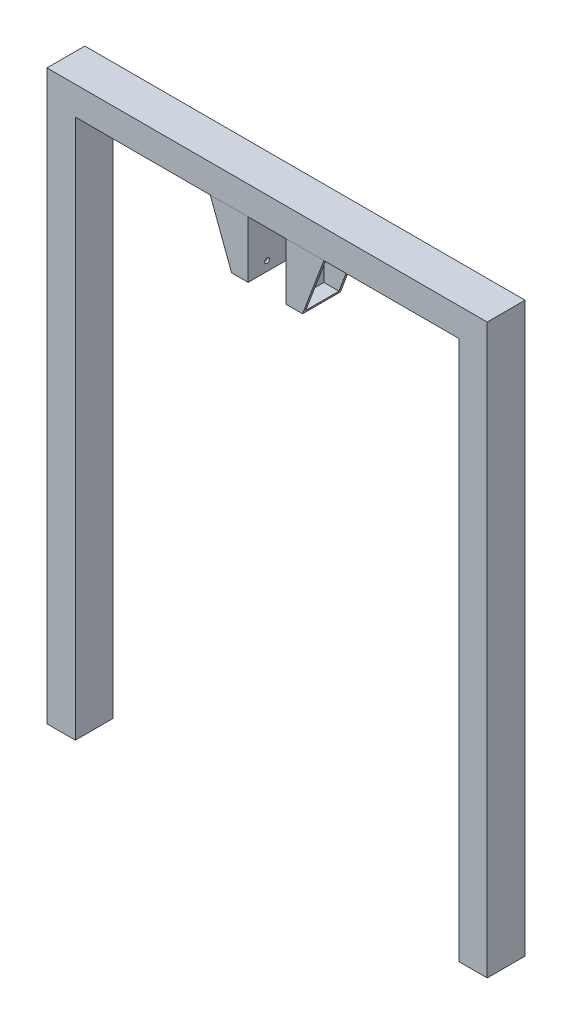
ISO-10303-21;
HEADER;
FILE_DESCRIPTION(('STEP AP214'),'2;1');
FILE_NAME('part.step','',(''),(''),'','','');
FILE_SCHEMA(('AUTOMOTIVE_DESIGN { 1 0 10303 214 1 1 1 1 }'));
ENDSEC;
DATA;
#1=APPLICATION_CONTEXT('core data for automotive mechanical design processes');
#2=APPLICATION_PROTOCOL_DEFINITION('international standard','automotive_design',2000,#1);
#3=PRODUCT_CONTEXT('',#1,'mechanical');
#4=PRODUCT('Part','Part','',(#3));
#5=PRODUCT_RELATED_PRODUCT_CATEGORY('part','',(#4));
#6=PRODUCT_DEFINITION_FORMATION('','',#4);
#7=PRODUCT_DEFINITION_CONTEXT('part definition',#1,'design');
#8=PRODUCT_DEFINITION('design','',#6,#7);
#9=PRODUCT_DEFINITION_SHAPE('','',#8);
#10=(LENGTH_UNIT() NAMED_UNIT(*) SI_UNIT(.MILLI.,.METRE.));
#11=(NAMED_UNIT(*) PLANE_ANGLE_UNIT() SI_UNIT($,.RADIAN.));
#12=(NAMED_UNIT(*) SI_UNIT($,.STERADIAN.) SOLID_ANGLE_UNIT());
#13=UNCERTAINTY_MEASURE_WITH_UNIT(LENGTH_MEASURE(1.E-05),#10,'distance_accuracy_value','');
#14=(GEOMETRIC_REPRESENTATION_CONTEXT(3) GLOBAL_UNCERTAINTY_ASSIGNED_CONTEXT((#13)) GLOBAL_UNIT_ASSIGNED_CONTEXT((#10,
#11,#12)) REPRESENTATION_CONTEXT('',''));
#15=CARTESIAN_POINT('',(0.,0.,0.));
#16=DIRECTION('',(0.,0.,1.));
#17=DIRECTION('',(1.,0.,0.));
#18=AXIS2_PLACEMENT_3D('',#15,#16,#17);
#19=CARTESIAN_POINT('',(0.,0.,0.));
#20=DIRECTION('',(0.,0.,1.));
#21=DIRECTION('',(1.,0.,0.));
#22=AXIS2_PLACEMENT_3D('',#19,#20,#21);
#23=PLANE('',#22);
#24=DIRECTION('',(0.,-1.,0.));
#25=VECTOR('',#24,1.);
#26=CARTESIAN_POINT('',(1358.9,3098.8,0.));
#27=LINE('',#26,#25);
#28=CARTESIAN_POINT('',(1358.9,3098.8,0.));
#29=VERTEX_POINT('',#28);
#30=CARTESIAN_POINT('',(1358.9,2794.,0.));
#31=VERTEX_POINT('',#30);
#32=EDGE_CURVE('E83',#29,#31,#27,.T.);
#33=ORIENTED_EDGE('',*,*,#32,.F.);
#34=DIRECTION('',(-1.,0.,0.));
#35=VECTOR('',#34,1.);
#36=CARTESIAN_POINT('',(1358.9,3098.8,0.));
#37=LINE('',#36,#35);
#38=CARTESIAN_POINT('',(1155.7,3098.8,0.));
#39=VERTEX_POINT('',#38);
#40=EDGE_CURVE('E12',#29,#39,#37,.T.);
#41=ORIENTED_EDGE('',*,*,#40,.T.);
#42=DIRECTION('',(0.351123441588385,-0.936329177569047,0.));
#43=VECTOR('',#42,1.);
#44=CARTESIAN_POINT('',(1155.7,3098.8,0.));
#45=LINE('',#44,#43);
#46=CARTESIAN_POINT('',(1270.,2794.,0.));
#47=VERTEX_POINT('',#46);
#48=EDGE_CURVE('E67',#39,#47,#45,.T.);
#49=ORIENTED_EDGE('',*,*,#48,.T.);
#50=DIRECTION('',(-1.,0.,0.));
#51=VECTOR('',#50,1.);
#52=CARTESIAN_POINT('',(1358.9,2794.,0.));
#53=LINE('',#52,#51);
#54=EDGE_CURVE('E107',#31,#47,#53,.T.);
#55=ORIENTED_EDGE('',*,*,#54,.F.);
#56=EDGE_LOOP('',(#33,#41,#49,#55));
#57=FACE_BOUND('',#56,.T.);
#58=ADVANCED_FACE('F57',(#57),#23,.T.);
#59=CARTESIAN_POINT('',(0.,0.,-203.2));
#60=DIRECTION('',(0.,0.,1.));
#61=DIRECTION('',(1.,0.,0.));
#62=AXIS2_PLACEMENT_3D('',#59,#60,#61);
#63=PLANE('',#62);
#64=DIRECTION('',(-1.,0.,0.));
#65=VECTOR('',#64,1.);
#66=CARTESIAN_POINT('',(1358.9,3098.8,-203.2));
#67=LINE('',#66,#65);
#68=CARTESIAN_POINT('',(1358.9,3098.8,-203.2));
#69=VERTEX_POINT('',#68);
#70=CARTESIAN_POINT('',(1155.7,3098.8,-203.2));
#71=VERTEX_POINT('',#70);
#72=EDGE_CURVE('E133',#69,#71,#67,.T.);
#73=ORIENTED_EDGE('',*,*,#72,.F.);
#74=DIRECTION('',(0.,-1.,0.));
#75=VECTOR('',#74,1.);
#76=CARTESIAN_POINT('',(1358.9,3098.8,-203.2));
#77=LINE('',#76,#75);
#78=CARTESIAN_POINT('',(1358.9,2794.,-203.2));
#79=VERTEX_POINT('',#78);
#80=EDGE_CURVE('E61',#69,#79,#77,.T.);
#81=ORIENTED_EDGE('',*,*,#80,.T.);
#82=DIRECTION('',(-1.,0.,0.));
#83=VECTOR('',#82,1.);
#84=CARTESIAN_POINT('',(1358.9,2794.,-203.2));
#85=LINE('',#84,#83);
#86=CARTESIAN_POINT('',(1270.,2794.,-203.2));
#87=VERTEX_POINT('',#86);
#88=EDGE_CURVE('E119',#79,#87,#85,.T.);
#89=ORIENTED_EDGE('',*,*,#88,.T.);
#90=DIRECTION('',(0.351123441588385,-0.936329177569047,0.));
#91=VECTOR('',#90,1.);
#92=CARTESIAN_POINT('',(1155.7,3098.8,-203.2));
#93=LINE('',#92,#91);
#94=EDGE_CURVE('E138',#71,#87,#93,.T.);
#95=ORIENTED_EDGE('',*,*,#94,.F.);
#96=EDGE_LOOP('',(#73,#81,#89,#95));
#97=FACE_BOUND('',#96,.T.);
#98=ADVANCED_FACE('F59',(#97),#63,.F.);
#99=CARTESIAN_POINT('',(1358.9,3098.8,366.324009587143));
#100=DIRECTION('',(1.,0.,0.));
#101=DIRECTION('',(0.,1.,0.));
#102=AXIS2_PLACEMENT_3D('',#99,#100,#101);
#103=PLANE('',#102);
#104=CARTESIAN_POINT('',(1358.9,2844.8,-101.6));
#105=DIRECTION('',(1.,0.,0.));
#106=DIRECTION('',(0.,1.,0.));
#107=AXIS2_PLACEMENT_3D('',#104,#105,#106);
#108=CIRCLE('',#107,12.7);
#109=CARTESIAN_POINT('',(1358.9,2857.5,-101.6));
#110=VERTEX_POINT('',#109);
#111=EDGE_CURVE('E186',#110,#110,#108,.T.);
#112=ORIENTED_EDGE('',*,*,#111,.F.);
#113=EDGE_LOOP('',(#112));
#114=FACE_BOUND('',#113,.T.);
#115=DIRECTION('',(0.,0.,-1.));
#116=VECTOR('',#115,1.);
#117=CARTESIAN_POINT('',(1358.9,3098.8,366.324009587143));
#118=LINE('',#117,#116);
#119=EDGE_CURVE('E127',#29,#69,#118,.T.);
#120=ORIENTED_EDGE('',*,*,#119,.F.);
#121=ORIENTED_EDGE('',*,*,#32,.T.);
#122=DIRECTION('',(0.,0.,-1.));
#123=VECTOR('',#122,1.);
#124=CARTESIAN_POINT('',(1358.9,2794.,366.324009587143));
#125=LINE('',#124,#123);
#126=EDGE_CURVE('E113',#31,#79,#125,.T.);
#127=ORIENTED_EDGE('',*,*,#126,.T.);
#128=ORIENTED_EDGE('',*,*,#80,.F.);
#129=EDGE_LOOP('',(#120,#121,#127,#128));
#130=FACE_BOUND('',#129,.T.);
#131=ADVANCED_FACE('F126',(#114,#130),#103,.T.);
#132=CARTESIAN_POINT('',(1358.9,2794.,366.324009587143));
#133=DIRECTION('',(0.,-1.,0.));
#134=DIRECTION('',(1.,0.,0.));
#135=AXIS2_PLACEMENT_3D('',#132,#133,#134);
#136=PLANE('',#135);
#137=ORIENTED_EDGE('',*,*,#126,.F.);
#138=ORIENTED_EDGE('',*,*,#54,.T.);
#139=DIRECTION('',(0.,0.,-1.));
#140=VECTOR('',#139,1.);
#141=CARTESIAN_POINT('',(1270.,2794.,366.324009587143));
#142=LINE('',#141,#140);
#143=EDGE_CURVE('E114',#47,#87,#142,.T.);
#144=ORIENTED_EDGE('',*,*,#143,.T.);
#145=ORIENTED_EDGE('',*,*,#88,.F.);
#146=EDGE_LOOP('',(#137,#138,#144,#145));
#147=FACE_BOUND('',#146,.T.);
#148=ADVANCED_FACE('F117',(#147),#136,.T.);
#149=CARTESIAN_POINT('',(1155.7,3098.8,366.324009587143));
#150=DIRECTION('',(0.936329177569047,0.351123441588385,0.));
#151=DIRECTION('',(-0.351123441588385,0.936329177569047,0.));
#152=AXIS2_PLACEMENT_3D('',#149,#150,#151);
#153=PLANE('',#152);
#154=DIRECTION('',(0.,0.,-1.));
#155=VECTOR('',#154,1.);
#156=CARTESIAN_POINT('',(1160.4625,3086.1,366.324009587143));
#157=LINE('',#156,#155);
#158=CARTESIAN_POINT('',(1160.4625,3086.1,-12.7));
#159=VERTEX_POINT('',#158);
#160=CARTESIAN_POINT('',(1160.4625,3086.1,-190.5));
#161=VERTEX_POINT('',#160);
#162=EDGE_CURVE('E228',#159,#161,#157,.T.);
#163=ORIENTED_EDGE('',*,*,#162,.F.);
#164=DIRECTION('',(0.351123441588385,-0.936329177569047,0.));
#165=VECTOR('',#164,1.);
#166=CARTESIAN_POINT('',(1155.7,3098.8,-12.7));
#167=LINE('',#166,#165);
#168=CARTESIAN_POINT('',(1265.2375,2806.7,-12.7));
#169=VERTEX_POINT('',#168);
#170=EDGE_CURVE('E208',#159,#169,#167,.T.);
#171=ORIENTED_EDGE('',*,*,#170,.T.);
#172=DIRECTION('',(0.,0.,-1.));
#173=VECTOR('',#172,1.);
#174=CARTESIAN_POINT('',(1265.2375,2806.7,366.324009587143));
#175=LINE('',#174,#173);
#176=CARTESIAN_POINT('',(1265.2375,2806.7,-190.5));
#177=VERTEX_POINT('',#176);
#178=EDGE_CURVE('E151',#169,#177,#175,.T.);
#179=ORIENTED_EDGE('',*,*,#178,.T.);
#180=DIRECTION('',(0.351123441588385,-0.936329177569047,0.));
#181=VECTOR('',#180,1.);
#182=CARTESIAN_POINT('',(1155.7,3098.8,-190.5));
#183=LINE('',#182,#181);
#184=EDGE_CURVE('E216',#161,#177,#183,.T.);
#185=ORIENTED_EDGE('',*,*,#184,.F.);
#186=EDGE_LOOP('',(#163,#171,#179,#185));
#187=FACE_BOUND('',#186,.T.);
#188=ORIENTED_EDGE('',*,*,#48,.F.);
#189=DIRECTION('',(0.,0.,-1.));
#190=VECTOR('',#189,1.);
#191=CARTESIAN_POINT('',(1155.7,3098.8,366.324009587143));
#192=LINE('',#191,#190);
#193=EDGE_CURVE('E141',#39,#71,#192,.T.);
#194=ORIENTED_EDGE('',*,*,#193,.T.);
#195=ORIENTED_EDGE('',*,*,#94,.T.);
#196=ORIENTED_EDGE('',*,*,#143,.F.);
#197=EDGE_LOOP('',(#188,#194,#195,#196));
#198=FACE_BOUND('',#197,.T.);
#199=ADVANCED_FACE('F160',(#187,#198),#153,.F.);
#200=CARTESIAN_POINT('',(1358.9,3098.8,366.324009587143));
#201=DIRECTION('',(0.,-1.,0.));
#202=DIRECTION('',(1.,0.,0.));
#203=AXIS2_PLACEMENT_3D('',#200,#201,#202);
#204=PLANE('',#203);
#205=ORIENTED_EDGE('',*,*,#40,.F.);
#206=ORIENTED_EDGE('',*,*,#119,.T.);
#207=ORIENTED_EDGE('',*,*,#72,.T.);
#208=ORIENTED_EDGE('',*,*,#193,.F.);
#209=EDGE_LOOP('',(#205,#206,#207,#208));
#210=FACE_BOUND('',#209,.T.);
#211=ADVANCED_FACE('F159',(#210),#204,.F.);
#212=CARTESIAN_POINT('',(0.,0.,-12.7));
#213=DIRECTION('',(0.,0.,1.));
#214=DIRECTION('',(1.,0.,0.));
#215=AXIS2_PLACEMENT_3D('',#212,#213,#214);
#216=PLANE('',#215);
#217=DIRECTION('',(0.,-1.,0.));
#218=VECTOR('',#217,1.);
#219=CARTESIAN_POINT('',(1346.2,3098.8,-12.7));
#220=LINE('',#219,#218);
#221=CARTESIAN_POINT('',(1346.2,3086.1,-12.7));
#222=VERTEX_POINT('',#221);
#223=CARTESIAN_POINT('',(1346.2,2806.7,-12.7));
#224=VERTEX_POINT('',#223);
#225=EDGE_CURVE('E200',#222,#224,#220,.T.);
#226=ORIENTED_EDGE('',*,*,#225,.T.);
#227=DIRECTION('',(-1.,0.,0.));
#228=VECTOR('',#227,1.);
#229=CARTESIAN_POINT('',(1358.9,2806.7,-12.7));
#230=LINE('',#229,#228);
#231=EDGE_CURVE('E209',#224,#169,#230,.T.);
#232=ORIENTED_EDGE('',*,*,#231,.T.);
#233=ORIENTED_EDGE('',*,*,#170,.F.);
#234=DIRECTION('',(-1.,0.,0.));
#235=VECTOR('',#234,1.);
#236=CARTESIAN_POINT('',(1358.9,3086.1,-12.7));
#237=LINE('',#236,#235);
#238=EDGE_CURVE('E137',#222,#159,#237,.T.);
#239=ORIENTED_EDGE('',*,*,#238,.F.);
#240=EDGE_LOOP('',(#226,#232,#233,#239));
#241=FACE_BOUND('',#240,.T.);
#242=ADVANCED_FACE('F168',(#241),#216,.F.);
#243=CARTESIAN_POINT('',(0.,0.,-190.5));
#244=DIRECTION('',(0.,0.,1.));
#245=DIRECTION('',(1.,0.,0.));
#246=AXIS2_PLACEMENT_3D('',#243,#244,#245);
#247=PLANE('',#246);
#248=DIRECTION('',(-1.,0.,0.));
#249=VECTOR('',#248,1.);
#250=CARTESIAN_POINT('',(1358.9,3086.1,-190.5));
#251=LINE('',#250,#249);
#252=CARTESIAN_POINT('',(1346.2,3086.1,-190.5));
#253=VERTEX_POINT('',#252);
#254=EDGE_CURVE('E189',#253,#161,#251,.T.);
#255=ORIENTED_EDGE('',*,*,#254,.T.);
#256=ORIENTED_EDGE('',*,*,#184,.T.);
#257=DIRECTION('',(-1.,0.,0.));
#258=VECTOR('',#257,1.);
#259=CARTESIAN_POINT('',(1358.9,2806.7,-190.5));
#260=LINE('',#259,#258);
#261=CARTESIAN_POINT('',(1346.2,2806.7,-190.5));
#262=VERTEX_POINT('',#261);
#263=EDGE_CURVE('E75',#262,#177,#260,.T.);
#264=ORIENTED_EDGE('',*,*,#263,.F.);
#265=DIRECTION('',(0.,-1.,0.));
#266=VECTOR('',#265,1.);
#267=CARTESIAN_POINT('',(1346.2,3098.8,-190.5));
#268=LINE('',#267,#266);
#269=EDGE_CURVE('E219',#253,#262,#268,.T.);
#270=ORIENTED_EDGE('',*,*,#269,.F.);
#271=EDGE_LOOP('',(#255,#256,#264,#270));
#272=FACE_BOUND('',#271,.T.);
#273=ADVANCED_FACE('F235',(#272),#247,.T.);
#274=CARTESIAN_POINT('',(1346.2,3098.8,366.324009587143));
#275=DIRECTION('',(1.,0.,0.));
#276=DIRECTION('',(0.,1.,0.));
#277=AXIS2_PLACEMENT_3D('',#274,#275,#276);
#278=PLANE('',#277);
#279=CARTESIAN_POINT('',(1346.2,2844.8,-101.6));
#280=DIRECTION('',(-1.,0.,0.));
#281=DIRECTION('',(0.,-1.,0.));
#282=AXIS2_PLACEMENT_3D('',#279,#280,#281);
#283=CIRCLE('',#282,12.7);
#284=CARTESIAN_POINT('',(1346.2,2832.1,-101.6));
#285=VERTEX_POINT('',#284);
#286=EDGE_CURVE('E190',#285,#285,#283,.T.);
#287=ORIENTED_EDGE('',*,*,#286,.F.);
#288=EDGE_LOOP('',(#287));
#289=FACE_BOUND('',#288,.T.);
#290=DIRECTION('',(0.,0.,-1.));
#291=VECTOR('',#290,1.);
#292=CARTESIAN_POINT('',(1346.2,3086.1,366.324009587143));
#293=LINE('',#292,#291);
#294=EDGE_CURVE('E195',#222,#253,#293,.T.);
#295=ORIENTED_EDGE('',*,*,#294,.T.);
#296=ORIENTED_EDGE('',*,*,#269,.T.);
#297=DIRECTION('',(0.,0.,-1.));
#298=VECTOR('',#297,1.);
#299=CARTESIAN_POINT('',(1346.2,2806.7,366.324009587143));
#300=LINE('',#299,#298);
#301=EDGE_CURVE('E204',#224,#262,#300,.T.);
#302=ORIENTED_EDGE('',*,*,#301,.F.);
#303=ORIENTED_EDGE('',*,*,#225,.F.);
#304=EDGE_LOOP('',(#295,#296,#302,#303));
#305=FACE_BOUND('',#304,.T.);
#306=ADVANCED_FACE('F253',(#289,#305),#278,.F.);
#307=CARTESIAN_POINT('',(1358.9,2806.7,366.324009587143));
#308=DIRECTION('',(0.,-1.,0.));
#309=DIRECTION('',(1.,0.,0.));
#310=AXIS2_PLACEMENT_3D('',#307,#308,#309);
#311=PLANE('',#310);
#312=ORIENTED_EDGE('',*,*,#301,.T.);
#313=ORIENTED_EDGE('',*,*,#263,.T.);
#314=ORIENTED_EDGE('',*,*,#178,.F.);
#315=ORIENTED_EDGE('',*,*,#231,.F.);
#316=EDGE_LOOP('',(#312,#313,#314,#315));
#317=FACE_BOUND('',#316,.T.);
#318=ADVANCED_FACE('F243',(#317),#311,.F.);
#319=CARTESIAN_POINT('',(1358.9,3086.1,366.324009587143));
#320=DIRECTION('',(0.,-1.,0.));
#321=DIRECTION('',(1.,0.,0.));
#322=AXIS2_PLACEMENT_3D('',#319,#320,#321);
#323=PLANE('',#322);
#324=ORIENTED_EDGE('',*,*,#238,.T.);
#325=ORIENTED_EDGE('',*,*,#162,.T.);
#326=ORIENTED_EDGE('',*,*,#254,.F.);
#327=ORIENTED_EDGE('',*,*,#294,.F.);
#328=EDGE_LOOP('',(#324,#325,#326,#327));
#329=FACE_BOUND('',#328,.T.);
#330=ADVANCED_FACE('F178',(#329),#323,.T.);
#331=CARTESIAN_POINT('',(1610.72102448428,2844.8,-101.6));
#332=DIRECTION('',(-1.,0.,0.));
#333=DIRECTION('',(0.,-1.,0.));
#334=AXIS2_PLACEMENT_3D('',#331,#332,#333);
#335=CYLINDRICAL_SURFACE('',#334,12.7);
#336=ORIENTED_EDGE('',*,*,#111,.T.);
#337=EDGE_LOOP('',(#336));
#338=FACE_BOUND('',#337,.T.);
#339=ORIENTED_EDGE('',*,*,#286,.T.);
#340=EDGE_LOOP('',(#339));
#341=FACE_BOUND('',#340,.T.);
#342=ADVANCED_FACE('F261',(#338,#341),#335,.F.);
#343=CLOSED_SHELL('',(#58,#98,#131,#148,#199,#211,#242,#273,#306,#318,#330,#342));
#344=MANIFOLD_SOLID_BREP('B2',#343);
#345=CARTESIAN_POINT('',(0.,0.,0.));
#346=DIRECTION('',(0.,0.,1.));
#347=DIRECTION('',(1.,0.,0.));
#348=AXIS2_PLACEMENT_3D('',#345,#346,#347);
#349=PLANE('',#348);
#350=DIRECTION('',(1.,0.,0.));
#351=VECTOR('',#350,1.);
#352=CARTESIAN_POINT('',(1562.1,3098.8,0.));
#353=LINE('',#352,#351);
#354=CARTESIAN_POINT('',(1562.1,3098.8,0.));
#355=VERTEX_POINT('',#354);
#356=CARTESIAN_POINT('',(1765.3,3098.8,0.));
#357=VERTEX_POINT('',#356);
#358=EDGE_CURVE('E422',#355,#357,#353,.T.);
#359=ORIENTED_EDGE('',*,*,#358,.F.);
#360=DIRECTION('',(0.,-1.,0.));
#361=VECTOR('',#360,1.);
#362=CARTESIAN_POINT('',(1562.1,3098.8,0.));
#363=LINE('',#362,#361);
#364=CARTESIAN_POINT('',(1562.1,2794.,0.));
#365=VERTEX_POINT('',#364);
#366=EDGE_CURVE('E489',#355,#365,#363,.T.);
#367=ORIENTED_EDGE('',*,*,#366,.T.);
#368=DIRECTION('',(1.,0.,0.));
#369=VECTOR('',#368,1.);
#370=CARTESIAN_POINT('',(1562.1,2794.,0.));
#371=LINE('',#370,#369);
#372=CARTESIAN_POINT('',(1651.,2794.,0.));
#373=VERTEX_POINT('',#372);
#374=EDGE_CURVE('E491',#365,#373,#371,.T.);
#375=ORIENTED_EDGE('',*,*,#374,.T.);
#376=DIRECTION('',(0.351123441588392,0.936329177569045,0.));
#377=VECTOR('',#376,1.);
#378=CARTESIAN_POINT('',(1651.,2794.,0.));
#379=LINE('',#378,#377);
#380=EDGE_CURVE('E478',#373,#357,#379,.T.);
#381=ORIENTED_EDGE('',*,*,#380,.T.);
#382=EDGE_LOOP('',(#359,#367,#375,#381));
#383=FACE_BOUND('',#382,.T.);
#384=ADVANCED_FACE('F375',(#383),#349,.T.);
#385=CARTESIAN_POINT('',(0.,0.,-203.2));
#386=DIRECTION('',(0.,0.,1.));
#387=DIRECTION('',(1.,0.,0.));
#388=AXIS2_PLACEMENT_3D('',#385,#386,#387);
#389=PLANE('',#388);
#390=DIRECTION('',(0.,-1.,0.));
#391=VECTOR('',#390,1.);
#392=CARTESIAN_POINT('',(1562.1,3098.8,-203.2));
#393=LINE('',#392,#391);
#394=CARTESIAN_POINT('',(1562.1,3098.8,-203.2));
#395=VERTEX_POINT('',#394);
#396=CARTESIAN_POINT('',(1562.1,2794.,-203.2));
#397=VERTEX_POINT('',#396);
#398=EDGE_CURVE('E55',#395,#397,#393,.T.);
#399=ORIENTED_EDGE('',*,*,#398,.F.);
#400=DIRECTION('',(1.,0.,0.));
#401=VECTOR('',#400,1.);
#402=CARTESIAN_POINT('',(1562.1,3098.8,-203.2));
#403=LINE('',#402,#401);
#404=CARTESIAN_POINT('',(1765.3,3098.8,-203.2));
#405=VERTEX_POINT('',#404);
#406=EDGE_CURVE('E475',#395,#405,#403,.T.);
#407=ORIENTED_EDGE('',*,*,#406,.T.);
#408=DIRECTION('',(0.351123441588392,0.936329177569044,0.));
#409=VECTOR('',#408,1.);
#410=CARTESIAN_POINT('',(1651.,2794.,-203.2));
#411=LINE('',#410,#409);
#412=CARTESIAN_POINT('',(1651.,2794.,-203.2));
#413=VERTEX_POINT('',#412);
#414=EDGE_CURVE('E479',#413,#405,#411,.T.);
#415=ORIENTED_EDGE('',*,*,#414,.F.);
#416=DIRECTION('',(1.,0.,0.));
#417=VECTOR('',#416,1.);
#418=CARTESIAN_POINT('',(1562.1,2794.,-203.2));
#419=LINE('',#418,#417);
#420=EDGE_CURVE('E484',#397,#413,#419,.T.);
#421=ORIENTED_EDGE('',*,*,#420,.F.);
#422=EDGE_LOOP('',(#399,#407,#415,#421));
#423=FACE_BOUND('',#422,.T.);
#424=ADVANCED_FACE('F505',(#423),#389,.F.);
#425=CARTESIAN_POINT('',(1562.1,3098.8,366.324009587143));
#426=DIRECTION('',(0.,1.,0.));
#427=DIRECTION('',(0.,0.,1.));
#428=AXIS2_PLACEMENT_3D('',#425,#426,#427);
#429=PLANE('',#428);
#430=DIRECTION('',(0.,0.,-1.));
#431=VECTOR('',#430,1.);
#432=CARTESIAN_POINT('',(1562.1,3098.8,366.324009587143));
#433=LINE('',#432,#431);
#434=EDGE_CURVE('E378',#355,#395,#433,.T.);
#435=ORIENTED_EDGE('',*,*,#434,.F.);
#436=ORIENTED_EDGE('',*,*,#358,.T.);
#437=DIRECTION('',(0.,0.,-1.));
#438=VECTOR('',#437,1.);
#439=CARTESIAN_POINT('',(1765.3,3098.8,366.324009587143));
#440=LINE('',#439,#438);
#441=EDGE_CURVE('E488',#357,#405,#440,.T.);
#442=ORIENTED_EDGE('',*,*,#441,.T.);
#443=ORIENTED_EDGE('',*,*,#406,.F.);
#444=EDGE_LOOP('',(#435,#436,#442,#443));
#445=FACE_BOUND('',#444,.T.);
#446=ADVANCED_FACE('F499',(#445),#429,.T.);
#447=CARTESIAN_POINT('',(1651.,2794.,366.324009587143));
#448=DIRECTION('',(-0.936329177569045,0.351123441588392,0.));
#449=DIRECTION('',(-0.351123441588392,-0.936329177569045,0.));
#450=AXIS2_PLACEMENT_3D('',#447,#448,#449);
#451=PLANE('',#450);
#452=DIRECTION('',(0.,0.,-1.));
#453=VECTOR('',#452,1.);
#454=CARTESIAN_POINT('',(1655.7625,2806.7,366.324009587143));
#455=LINE('',#454,#453);
#456=CARTESIAN_POINT('',(1655.7625,2806.7,-12.7));
#457=VERTEX_POINT('',#456);
#458=CARTESIAN_POINT('',(1655.7625,2806.7,-190.5));
#459=VERTEX_POINT('',#458);
#460=EDGE_CURVE('E451',#457,#459,#455,.T.);
#461=ORIENTED_EDGE('',*,*,#460,.F.);
#462=DIRECTION('',(0.351123441588392,0.936329177569045,0.));
#463=VECTOR('',#462,1.);
#464=CARTESIAN_POINT('',(1651.,2794.,-12.7));
#465=LINE('',#464,#463);
#466=CARTESIAN_POINT('',(1760.5375,3086.1,-12.7));
#467=VERTEX_POINT('',#466);
#468=EDGE_CURVE('E457',#457,#467,#465,.T.);
#469=ORIENTED_EDGE('',*,*,#468,.T.);
#470=DIRECTION('',(0.,0.,-1.));
#471=VECTOR('',#470,1.);
#472=CARTESIAN_POINT('',(1760.5375,3086.1,366.324009587143));
#473=LINE('',#472,#471);
#474=CARTESIAN_POINT('',(1760.5375,3086.1,-190.5));
#475=VERTEX_POINT('',#474);
#476=EDGE_CURVE('E442',#467,#475,#473,.T.);
#477=ORIENTED_EDGE('',*,*,#476,.T.);
#478=DIRECTION('',(0.351123441588392,0.936329177569045,0.));
#479=VECTOR('',#478,1.);
#480=CARTESIAN_POINT('',(1651.,2794.,-190.5));
#481=LINE('',#480,#479);
#482=EDGE_CURVE('E473',#459,#475,#481,.T.);
#483=ORIENTED_EDGE('',*,*,#482,.F.);
#484=EDGE_LOOP('',(#461,#469,#477,#483));
#485=FACE_BOUND('',#484,.T.);
#486=ORIENTED_EDGE('',*,*,#380,.F.);
#487=DIRECTION('',(0.,0.,-1.));
#488=VECTOR('',#487,1.);
#489=CARTESIAN_POINT('',(1651.,2794.,366.324009587143));
#490=LINE('',#489,#488);
#491=EDGE_CURVE('E483',#373,#413,#490,.T.);
#492=ORIENTED_EDGE('',*,*,#491,.T.);
#493=ORIENTED_EDGE('',*,*,#414,.T.);
#494=ORIENTED_EDGE('',*,*,#441,.F.);
#495=EDGE_LOOP('',(#486,#492,#493,#494));
#496=FACE_BOUND('',#495,.T.);
#497=ADVANCED_FACE('F462',(#485,#496),#451,.F.);
#498=CARTESIAN_POINT('',(1562.1,2794.,366.324009587143));
#499=DIRECTION('',(0.,1.,0.));
#500=DIRECTION('',(0.,0.,1.));
#501=AXIS2_PLACEMENT_3D('',#498,#499,#500);
#502=PLANE('',#501);
#503=ORIENTED_EDGE('',*,*,#374,.F.);
#504=DIRECTION('',(0.,0.,-1.));
#505=VECTOR('',#504,1.);
#506=CARTESIAN_POINT('',(1562.1,2794.,366.324009587143));
#507=LINE('',#506,#505);
#508=EDGE_CURVE('E482',#365,#397,#507,.T.);
#509=ORIENTED_EDGE('',*,*,#508,.T.);
#510=ORIENTED_EDGE('',*,*,#420,.T.);
#511=ORIENTED_EDGE('',*,*,#491,.F.);
#512=EDGE_LOOP('',(#503,#509,#510,#511));
#513=FACE_BOUND('',#512,.T.);
#514=ADVANCED_FACE('F510',(#513),#502,.F.);
#515=CARTESIAN_POINT('',(1562.1,3098.8,366.324009587143));
#516=DIRECTION('',(1.,0.,0.));
#517=DIRECTION('',(0.,0.,-1.));
#518=AXIS2_PLACEMENT_3D('',#515,#516,#517);
#519=PLANE('',#518);
#520=CARTESIAN_POINT('',(1562.1,2844.8,-101.6));
#521=DIRECTION('',(1.,0.,0.));
#522=DIRECTION('',(0.,0.,-1.));
#523=AXIS2_PLACEMENT_3D('',#520,#521,#522);
#524=CIRCLE('',#523,12.7);
#525=CARTESIAN_POINT('',(1562.1,2844.8,-114.3));
#526=VERTEX_POINT('',#525);
#527=EDGE_CURVE('E644',#526,#526,#524,.T.);
#528=ORIENTED_EDGE('',*,*,#527,.T.);
#529=EDGE_LOOP('',(#528));
#530=FACE_BOUND('',#529,.T.);
#531=ORIENTED_EDGE('',*,*,#366,.F.);
#532=ORIENTED_EDGE('',*,*,#434,.T.);
#533=ORIENTED_EDGE('',*,*,#398,.T.);
#534=ORIENTED_EDGE('',*,*,#508,.F.);
#535=EDGE_LOOP('',(#531,#532,#533,#534));
#536=FACE_BOUND('',#535,.T.);
#537=ADVANCED_FACE('F507',(#530,#536),#519,.F.);
#538=CARTESIAN_POINT('',(0.,0.,-12.7));
#539=DIRECTION('',(0.,0.,1.));
#540=DIRECTION('',(1.,0.,0.));
#541=AXIS2_PLACEMENT_3D('',#538,#539,#540);
#542=PLANE('',#541);
#543=DIRECTION('',(1.,0.,0.));
#544=VECTOR('',#543,1.);
#545=CARTESIAN_POINT('',(1562.1,3086.1,-12.7));
#546=LINE('',#545,#544);
#547=CARTESIAN_POINT('',(1574.8,3086.1,-12.7));
#548=VERTEX_POINT('',#547);
#549=EDGE_CURVE('E446',#548,#467,#546,.T.);
#550=ORIENTED_EDGE('',*,*,#549,.T.);
#551=ORIENTED_EDGE('',*,*,#468,.F.);
#552=DIRECTION('',(1.,0.,0.));
#553=VECTOR('',#552,1.);
#554=CARTESIAN_POINT('',(1562.1,2806.7,-12.7));
#555=LINE('',#554,#553);
#556=CARTESIAN_POINT('',(1574.8,2806.7,-12.7));
#557=VERTEX_POINT('',#556);
#558=EDGE_CURVE('E464',#557,#457,#555,.T.);
#559=ORIENTED_EDGE('',*,*,#558,.F.);
#560=DIRECTION('',(0.,-1.,0.));
#561=VECTOR('',#560,1.);
#562=CARTESIAN_POINT('',(1574.8,3098.8,-12.7));
#563=LINE('',#562,#561);
#564=EDGE_CURVE('E460',#548,#557,#563,.T.);
#565=ORIENTED_EDGE('',*,*,#564,.F.);
#566=EDGE_LOOP('',(#550,#551,#559,#565));
#567=FACE_BOUND('',#566,.T.);
#568=ADVANCED_FACE('F455',(#567),#542,.F.);
#569=CARTESIAN_POINT('',(0.,0.,-190.5));
#570=DIRECTION('',(0.,0.,1.));
#571=DIRECTION('',(1.,0.,0.));
#572=AXIS2_PLACEMENT_3D('',#569,#570,#571);
#573=PLANE('',#572);
#574=DIRECTION('',(0.,-1.,0.));
#575=VECTOR('',#574,1.);
#576=CARTESIAN_POINT('',(1574.8,3098.8,-190.5));
#577=LINE('',#576,#575);
#578=CARTESIAN_POINT('',(1574.8,3086.1,-190.5));
#579=VERTEX_POINT('',#578);
#580=CARTESIAN_POINT('',(1574.8,2806.7,-190.5));
#581=VERTEX_POINT('',#580);
#582=EDGE_CURVE('E492',#579,#581,#577,.T.);
#583=ORIENTED_EDGE('',*,*,#582,.T.);
#584=DIRECTION('',(1.,0.,0.));
#585=VECTOR('',#584,1.);
#586=CARTESIAN_POINT('',(1562.1,2806.7,-190.5));
#587=LINE('',#586,#585);
#588=EDGE_CURVE('E649',#581,#459,#587,.T.);
#589=ORIENTED_EDGE('',*,*,#588,.T.);
#590=ORIENTED_EDGE('',*,*,#482,.T.);
#591=DIRECTION('',(1.,0.,0.));
#592=VECTOR('',#591,1.);
#593=CARTESIAN_POINT('',(1562.1,3086.1,-190.5));
#594=LINE('',#593,#592);
#595=EDGE_CURVE('E390',#579,#475,#594,.T.);
#596=ORIENTED_EDGE('',*,*,#595,.F.);
#597=EDGE_LOOP('',(#583,#589,#590,#596));
#598=FACE_BOUND('',#597,.T.);
#599=ADVANCED_FACE('F549',(#598),#573,.T.);
#600=CARTESIAN_POINT('',(1562.1,3086.1,366.324009587143));
#601=DIRECTION('',(0.,1.,0.));
#602=DIRECTION('',(0.,0.,1.));
#603=AXIS2_PLACEMENT_3D('',#600,#601,#602);
#604=PLANE('',#603);
#605=DIRECTION('',(0.,0.,-1.));
#606=VECTOR('',#605,1.);
#607=CARTESIAN_POINT('',(1574.8,3086.1,366.324009587143));
#608=LINE('',#607,#606);
#609=EDGE_CURVE('E427',#548,#579,#608,.T.);
#610=ORIENTED_EDGE('',*,*,#609,.T.);
#611=ORIENTED_EDGE('',*,*,#595,.T.);
#612=ORIENTED_EDGE('',*,*,#476,.F.);
#613=ORIENTED_EDGE('',*,*,#549,.F.);
#614=EDGE_LOOP('',(#610,#611,#612,#613));
#615=FACE_BOUND('',#614,.T.);
#616=ADVANCED_FACE('F444',(#615),#604,.F.);
#617=CARTESIAN_POINT('',(1562.1,2806.7,366.324009587143));
#618=DIRECTION('',(0.,1.,0.));
#619=DIRECTION('',(0.,0.,1.));
#620=AXIS2_PLACEMENT_3D('',#617,#618,#619);
#621=PLANE('',#620);
#622=ORIENTED_EDGE('',*,*,#558,.T.);
#623=ORIENTED_EDGE('',*,*,#460,.T.);
#624=ORIENTED_EDGE('',*,*,#588,.F.);
#625=DIRECTION('',(0.,0.,-1.));
#626=VECTOR('',#625,1.);
#627=CARTESIAN_POINT('',(1574.8,2806.7,366.324009587143));
#628=LINE('',#627,#626);
#629=EDGE_CURVE('E470',#557,#581,#628,.T.);
#630=ORIENTED_EDGE('',*,*,#629,.F.);
#631=EDGE_LOOP('',(#622,#623,#624,#630));
#632=FACE_BOUND('',#631,.T.);
#633=ADVANCED_FACE('F563',(#632),#621,.T.);
#634=CARTESIAN_POINT('',(1574.8,3098.8,366.324009587143));
#635=DIRECTION('',(1.,0.,0.));
#636=DIRECTION('',(0.,0.,-1.));
#637=AXIS2_PLACEMENT_3D('',#634,#635,#636);
#638=PLANE('',#637);
#639=CARTESIAN_POINT('',(1574.8,2844.8,-101.6));
#640=DIRECTION('',(1.,0.,0.));
#641=DIRECTION('',(0.,0.,-1.));
#642=AXIS2_PLACEMENT_3D('',#639,#640,#641);
#643=CIRCLE('',#642,12.7);
#644=CARTESIAN_POINT('',(1574.8,2844.8,-114.3));
#645=VERTEX_POINT('',#644);
#646=EDGE_CURVE('E641',#645,#645,#643,.F.);
#647=ORIENTED_EDGE('',*,*,#646,.T.);
#648=EDGE_LOOP('',(#647));
#649=FACE_BOUND('',#648,.T.);
#650=ORIENTED_EDGE('',*,*,#564,.T.);
#651=ORIENTED_EDGE('',*,*,#629,.T.);
#652=ORIENTED_EDGE('',*,*,#582,.F.);
#653=ORIENTED_EDGE('',*,*,#609,.F.);
#654=EDGE_LOOP('',(#650,#651,#652,#653));
#655=FACE_BOUND('',#654,.T.);
#656=ADVANCED_FACE('F521',(#649,#655),#638,.T.);
#657=CARTESIAN_POINT('',(1610.72102448428,2844.8,-101.6));
#658=DIRECTION('',(-1.,0.,0.));
#659=DIRECTION('',(0.,-1.,0.));
#660=AXIS2_PLACEMENT_3D('',#657,#658,#659);
#661=CYLINDRICAL_SURFACE('',#660,12.7);
#662=ORIENTED_EDGE('',*,*,#646,.F.);
#663=EDGE_LOOP('',(#662));
#664=FACE_BOUND('',#663,.T.);
#665=ORIENTED_EDGE('',*,*,#527,.F.);
#666=EDGE_LOOP('',(#665));
#667=FACE_BOUND('',#666,.T.);
#668=ADVANCED_FACE('F574',(#664,#667),#661,.F.);
#669=CLOSED_SHELL('',(#384,#424,#446,#497,#514,#537,#568,#599,#616,#633,#656,#668));
#670=MANIFOLD_SOLID_BREP('B6',#669);
#671=CARTESIAN_POINT('',(0.,3098.8,-203.2));
#672=DIRECTION('',(0.,1.,0.));
#673=DIRECTION('',(0.,0.,1.));
#674=AXIS2_PLACEMENT_3D('',#671,#672,#673);
#675=PLANE('',#674);
#676=DIRECTION('',(-1.,0.,0.));
#677=VECTOR('',#676,1.);
#678=CARTESIAN_POINT('',(0.,3098.8,0.));
#679=LINE('',#678,#677);
#680=CARTESIAN_POINT('',(2489.2,3098.8,0.));
#681=VERTEX_POINT('',#680);
#682=CARTESIAN_POINT('',(431.8,3098.8,0.));
#683=VERTEX_POINT('',#682);
#684=EDGE_CURVE('E753',#681,#683,#679,.T.);
#685=ORIENTED_EDGE('',*,*,#684,.T.);
#686=DIRECTION('',(0.,0.,1.));
#687=VECTOR('',#686,1.);
#688=CARTESIAN_POINT('',(431.8,3098.8,-203.2));
#689=LINE('',#688,#687);
#690=CARTESIAN_POINT('',(431.8,3098.8,-203.2));
#691=VERTEX_POINT('',#690);
#692=EDGE_CURVE('E373',#691,#683,#689,.T.);
#693=ORIENTED_EDGE('',*,*,#692,.F.);
#694=DIRECTION('',(-1.,0.,0.));
#695=VECTOR('',#694,1.);
#696=CARTESIAN_POINT('',(0.,3098.8,-203.2));
#697=LINE('',#696,#695);
#698=CARTESIAN_POINT('',(2489.2,3098.8,-203.2));
#699=VERTEX_POINT('',#698);
#700=EDGE_CURVE('E676',#699,#691,#697,.T.);
#701=ORIENTED_EDGE('',*,*,#700,.F.);
#702=DIRECTION('',(0.,0.,1.));
#703=VECTOR('',#702,1.);
#704=CARTESIAN_POINT('',(2489.2,3098.8,-203.2));
#705=LINE('',#704,#703);
#706=EDGE_CURVE('E661',#699,#681,#705,.T.);
#707=ORIENTED_EDGE('',*,*,#706,.T.);
#708=EDGE_LOOP('',(#685,#693,#701,#707));
#709=FACE_BOUND('',#708,.T.);
#710=ADVANCED_FACE('F658',(#709),#675,.F.);
#711=CARTESIAN_POINT('',(431.8,0.,-203.2));
#712=DIRECTION('',(1.,0.,0.));
#713=DIRECTION('',(0.,0.,-1.));
#714=AXIS2_PLACEMENT_3D('',#711,#712,#713);
#715=PLANE('',#714);
#716=DIRECTION('',(0.,1.,0.));
#717=VECTOR('',#716,1.);
#718=CARTESIAN_POINT('',(431.8,0.,0.));
#719=LINE('',#718,#717);
#720=CARTESIAN_POINT('',(431.8,203.2,0.));
#721=VERTEX_POINT('',#720);
#722=EDGE_CURVE('E766',#721,#683,#719,.T.);
#723=ORIENTED_EDGE('',*,*,#722,.F.);
#724=DIRECTION('',(0.,0.,1.));
#725=VECTOR('',#724,1.);
#726=CARTESIAN_POINT('',(431.8,203.2,-203.2));
#727=LINE('',#726,#725);
#728=CARTESIAN_POINT('',(431.8,203.2,-203.2));
#729=VERTEX_POINT('',#728);
#730=EDGE_CURVE('E667',#729,#721,#727,.T.);
#731=ORIENTED_EDGE('',*,*,#730,.F.);
#732=DIRECTION('',(0.,1.,0.));
#733=VECTOR('',#732,1.);
#734=CARTESIAN_POINT('',(431.8,0.,-203.2));
#735=LINE('',#734,#733);
#736=EDGE_CURVE('E734',#729,#691,#735,.T.);
#737=ORIENTED_EDGE('',*,*,#736,.T.);
#738=ORIENTED_EDGE('',*,*,#692,.T.);
#739=EDGE_LOOP('',(#723,#731,#737,#738));
#740=FACE_BOUND('',#739,.T.);
#741=ADVANCED_FACE('F787',(#740),#715,.T.);
#742=CARTESIAN_POINT('',(0.,203.2,-203.2));
#743=DIRECTION('',(0.,1.,0.));
#744=DIRECTION('',(0.,0.,1.));
#745=AXIS2_PLACEMENT_3D('',#742,#743,#744);
#746=PLANE('',#745);
#747=DIRECTION('',(-1.,0.,0.));
#748=VECTOR('',#747,1.);
#749=CARTESIAN_POINT('',(0.,203.2,0.));
#750=LINE('',#749,#748);
#751=CARTESIAN_POINT('',(279.4,203.2,0.));
#752=VERTEX_POINT('',#751);
#753=EDGE_CURVE('E738',#721,#752,#750,.T.);
#754=ORIENTED_EDGE('',*,*,#753,.T.);
#755=DIRECTION('',(0.,0.,1.));
#756=VECTOR('',#755,1.);
#757=CARTESIAN_POINT('',(279.4,203.2,-203.2));
#758=LINE('',#757,#756);
#759=CARTESIAN_POINT('',(279.4,203.2,-203.2));
#760=VERTEX_POINT('',#759);
#761=EDGE_CURVE('E736',#760,#752,#758,.T.);
#762=ORIENTED_EDGE('',*,*,#761,.F.);
#763=DIRECTION('',(-1.,0.,0.));
#764=VECTOR('',#763,1.);
#765=CARTESIAN_POINT('',(0.,203.2,-203.2));
#766=LINE('',#765,#764);
#767=EDGE_CURVE('E729',#729,#760,#766,.T.);
#768=ORIENTED_EDGE('',*,*,#767,.F.);
#769=ORIENTED_EDGE('',*,*,#730,.T.);
#770=EDGE_LOOP('',(#754,#762,#768,#769));
#771=FACE_BOUND('',#770,.T.);
#772=ADVANCED_FACE('F737',(#771),#746,.F.);
#773=CARTESIAN_POINT('',(279.4,0.,-203.2));
#774=DIRECTION('',(-1.,0.,0.));
#775=DIRECTION('',(0.,-1.,0.));
#776=AXIS2_PLACEMENT_3D('',#773,#774,#775);
#777=PLANE('',#776);
#778=DIRECTION('',(0.,-1.,0.));
#779=VECTOR('',#778,1.);
#780=CARTESIAN_POINT('',(279.4,0.,0.));
#781=LINE('',#780,#779);
#782=CARTESIAN_POINT('',(279.4,3251.2,0.));
#783=VERTEX_POINT('',#782);
#784=EDGE_CURVE('E763',#783,#752,#781,.T.);
#785=ORIENTED_EDGE('',*,*,#784,.F.);
#786=DIRECTION('',(0.,0.,1.));
#787=VECTOR('',#786,1.);
#788=CARTESIAN_POINT('',(279.4,3251.2,-203.2));
#789=LINE('',#788,#787);
#790=CARTESIAN_POINT('',(279.4,3251.2,-203.2));
#791=VERTEX_POINT('',#790);
#792=EDGE_CURVE('E742',#791,#783,#789,.T.);
#793=ORIENTED_EDGE('',*,*,#792,.F.);
#794=DIRECTION('',(0.,-1.,0.));
#795=VECTOR('',#794,1.);
#796=CARTESIAN_POINT('',(279.4,0.,-203.2));
#797=LINE('',#796,#795);
#798=EDGE_CURVE('E733',#791,#760,#797,.T.);
#799=ORIENTED_EDGE('',*,*,#798,.T.);
#800=ORIENTED_EDGE('',*,*,#761,.T.);
#801=EDGE_LOOP('',(#785,#793,#799,#800));
#802=FACE_BOUND('',#801,.T.);
#803=ADVANCED_FACE('F744',(#802),#777,.T.);
#804=CARTESIAN_POINT('',(0.,3251.2,-203.2));
#805=DIRECTION('',(0.,-1.,0.));
#806=DIRECTION('',(0.,0.,-1.));
#807=AXIS2_PLACEMENT_3D('',#804,#805,#806);
#808=PLANE('',#807);
#809=DIRECTION('',(1.,0.,0.));
#810=VECTOR('',#809,1.);
#811=CARTESIAN_POINT('',(0.,3251.2,0.));
#812=LINE('',#811,#810);
#813=CARTESIAN_POINT('',(2641.6,3251.2,0.));
#814=VERTEX_POINT('',#813);
#815=EDGE_CURVE('E761',#783,#814,#812,.T.);
#816=ORIENTED_EDGE('',*,*,#815,.T.);
#817=DIRECTION('',(0.,0.,1.));
#818=VECTOR('',#817,1.);
#819=CARTESIAN_POINT('',(2641.6,3251.2,-203.2));
#820=LINE('',#819,#818);
#821=CARTESIAN_POINT('',(2641.6,3251.2,-203.2));
#822=VERTEX_POINT('',#821);
#823=EDGE_CURVE('E771',#822,#814,#820,.T.);
#824=ORIENTED_EDGE('',*,*,#823,.F.);
#825=DIRECTION('',(1.,0.,0.));
#826=VECTOR('',#825,1.);
#827=CARTESIAN_POINT('',(0.,3251.2,-203.2));
#828=LINE('',#827,#826);
#829=EDGE_CURVE('E746',#791,#822,#828,.T.);
#830=ORIENTED_EDGE('',*,*,#829,.F.);
#831=ORIENTED_EDGE('',*,*,#792,.T.);
#832=EDGE_LOOP('',(#816,#824,#830,#831));
#833=FACE_BOUND('',#832,.T.);
#834=ADVANCED_FACE('F800',(#833),#808,.F.);
#835=CARTESIAN_POINT('',(2641.59999999999,-4.81096644004235E-12,-203.2));
#836=DIRECTION('',(-1.,0.,0.));
#837=DIRECTION('',(0.,-1.,0.));
#838=AXIS2_PLACEMENT_3D('',#835,#836,#837);
#839=PLANE('',#838);
#840=DIRECTION('',(0.,-1.,0.));
#841=VECTOR('',#840,1.);
#842=CARTESIAN_POINT('',(2641.59999999999,-4.81096644004235E-12,0.));
#843=LINE('',#842,#841);
#844=CARTESIAN_POINT('',(2641.6,203.2,0.));
#845=VERTEX_POINT('',#844);
#846=EDGE_CURVE('E759',#814,#845,#843,.T.);
#847=ORIENTED_EDGE('',*,*,#846,.T.);
#848=DIRECTION('',(0.,0.,1.));
#849=VECTOR('',#848,1.);
#850=CARTESIAN_POINT('',(2641.6,203.2,-203.2));
#851=LINE('',#850,#849);
#852=CARTESIAN_POINT('',(2641.6,203.2,-203.2));
#853=VERTEX_POINT('',#852);
#854=EDGE_CURVE('E774',#853,#845,#851,.T.);
#855=ORIENTED_EDGE('',*,*,#854,.F.);
#856=DIRECTION('',(0.,-1.,0.));
#857=VECTOR('',#856,1.);
#858=CARTESIAN_POINT('',(2641.59999999999,-4.81096644004235E-12,-203.2));
#859=LINE('',#858,#857);
#860=EDGE_CURVE('E748',#822,#853,#859,.T.);
#861=ORIENTED_EDGE('',*,*,#860,.F.);
#862=ORIENTED_EDGE('',*,*,#823,.T.);
#863=EDGE_LOOP('',(#847,#855,#861,#862));
#864=FACE_BOUND('',#863,.T.);
#865=ADVANCED_FACE('F803',(#864),#839,.F.);
#866=CARTESIAN_POINT('',(0.,203.2,-203.2));
#867=DIRECTION('',(0.,1.,0.));
#868=DIRECTION('',(0.,0.,1.));
#869=AXIS2_PLACEMENT_3D('',#866,#867,#868);
#870=PLANE('',#869);
#871=DIRECTION('',(-1.,0.,0.));
#872=VECTOR('',#871,1.);
#873=CARTESIAN_POINT('',(0.,203.2,0.));
#874=LINE('',#873,#872);
#875=CARTESIAN_POINT('',(2489.2,203.2,0.));
#876=VERTEX_POINT('',#875);
#877=EDGE_CURVE('E757',#845,#876,#874,.T.);
#878=ORIENTED_EDGE('',*,*,#877,.T.);
#879=DIRECTION('',(0.,0.,1.));
#880=VECTOR('',#879,1.);
#881=CARTESIAN_POINT('',(2489.2,203.2,-203.2));
#882=LINE('',#881,#880);
#883=CARTESIAN_POINT('',(2489.2,203.2,-203.2));
#884=VERTEX_POINT('',#883);
#885=EDGE_CURVE('E776',#884,#876,#882,.T.);
#886=ORIENTED_EDGE('',*,*,#885,.F.);
#887=DIRECTION('',(-1.,0.,0.));
#888=VECTOR('',#887,1.);
#889=CARTESIAN_POINT('',(0.,203.2,-203.2));
#890=LINE('',#889,#888);
#891=EDGE_CURVE('E929',#853,#884,#890,.T.);
#892=ORIENTED_EDGE('',*,*,#891,.F.);
#893=ORIENTED_EDGE('',*,*,#854,.T.);
#894=EDGE_LOOP('',(#878,#886,#892,#893));
#895=FACE_BOUND('',#894,.T.);
#896=ADVANCED_FACE('F807',(#895),#870,.F.);
#897=CARTESIAN_POINT('',(2489.2,0.,-203.2));
#898=DIRECTION('',(1.,0.,0.));
#899=DIRECTION('',(0.,0.,-1.));
#900=AXIS2_PLACEMENT_3D('',#897,#898,#899);
#901=PLANE('',#900);
#902=DIRECTION('',(0.,1.,0.));
#903=VECTOR('',#902,1.);
#904=CARTESIAN_POINT('',(2489.2,0.,0.));
#905=LINE('',#904,#903);
#906=EDGE_CURVE('E755',#876,#681,#905,.T.);
#907=ORIENTED_EDGE('',*,*,#906,.T.);
#908=ORIENTED_EDGE('',*,*,#706,.F.);
#909=DIRECTION('',(0.,1.,0.));
#910=VECTOR('',#909,1.);
#911=CARTESIAN_POINT('',(2489.2,0.,-203.2));
#912=LINE('',#911,#910);
#913=EDGE_CURVE('E715',#884,#699,#912,.T.);
#914=ORIENTED_EDGE('',*,*,#913,.F.);
#915=ORIENTED_EDGE('',*,*,#885,.T.);
#916=EDGE_LOOP('',(#907,#908,#914,#915));
#917=FACE_BOUND('',#916,.T.);
#918=ADVANCED_FACE('F810',(#917),#901,.F.);
#919=CARTESIAN_POINT('',(0.,0.,-203.2));
#920=DIRECTION('',(0.,0.,1.));
#921=DIRECTION('',(1.,0.,0.));
#922=AXIS2_PLACEMENT_3D('',#919,#920,#921);
#923=PLANE('',#922);
#924=ORIENTED_EDGE('',*,*,#700,.T.);
#925=ORIENTED_EDGE('',*,*,#736,.F.);
#926=ORIENTED_EDGE('',*,*,#767,.T.);
#927=ORIENTED_EDGE('',*,*,#798,.F.);
#928=ORIENTED_EDGE('',*,*,#829,.T.);
#929=ORIENTED_EDGE('',*,*,#860,.T.);
#930=ORIENTED_EDGE('',*,*,#891,.T.);
#931=ORIENTED_EDGE('',*,*,#913,.T.);
#932=EDGE_LOOP('',(#924,#925,#926,#927,#928,#929,#930,#931));
#933=FACE_BOUND('',#932,.T.);
#934=ADVANCED_FACE('F731',(#933),#923,.F.);
#935=CARTESIAN_POINT('',(0.,0.,0.));
#936=DIRECTION('',(0.,0.,1.));
#937=DIRECTION('',(1.,0.,0.));
#938=AXIS2_PLACEMENT_3D('',#935,#936,#937);
#939=PLANE('',#938);
#940=ORIENTED_EDGE('',*,*,#684,.F.);
#941=ORIENTED_EDGE('',*,*,#906,.F.);
#942=ORIENTED_EDGE('',*,*,#877,.F.);
#943=ORIENTED_EDGE('',*,*,#846,.F.);
#944=ORIENTED_EDGE('',*,*,#815,.F.);
#945=ORIENTED_EDGE('',*,*,#784,.T.);
#946=ORIENTED_EDGE('',*,*,#753,.F.);
#947=ORIENTED_EDGE('',*,*,#722,.T.);
#948=EDGE_LOOP('',(#940,#941,#942,#943,#944,#945,#946,#947));
#949=FACE_BOUND('',#948,.T.);
#950=ADVANCED_FACE('F785',(#949),#939,.T.);
#951=CLOSED_SHELL('',(#710,#741,#772,#803,#834,#865,#896,#918,#934,#950));
#952=MANIFOLD_SOLID_BREP('B49',#951);
#953=ADVANCED_BREP_SHAPE_REPRESENTATION('',(#18,#344,#670,#952),#14);
#954=SHAPE_DEFINITION_REPRESENTATION(#9,#953);
ENDSEC;
END-ISO-10303-21;
